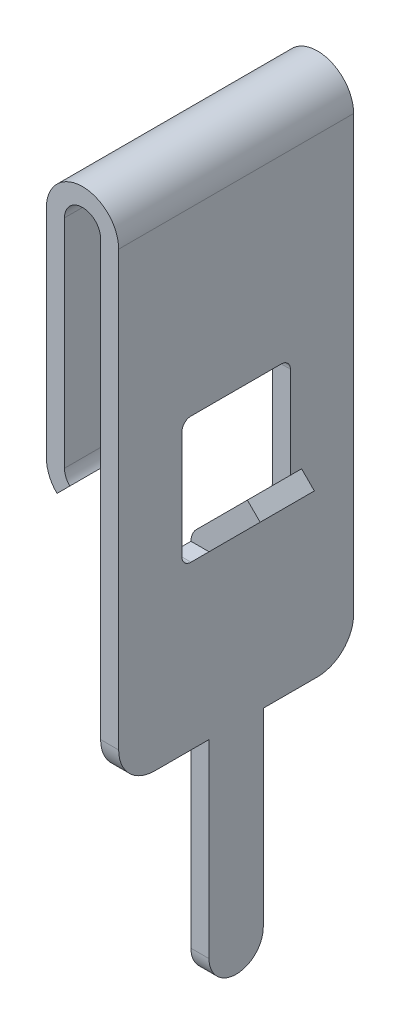
ISO-10303-21;
HEADER;
FILE_DESCRIPTION(('STEP AP214'),'2;1');
FILE_NAME('part.step','',(''),(''),'','','');
FILE_SCHEMA(('AUTOMOTIVE_DESIGN { 1 0 10303 214 1 1 1 1 }'));
ENDSEC;
DATA;
#1=APPLICATION_CONTEXT('core data for automotive mechanical design processes');
#2=APPLICATION_PROTOCOL_DEFINITION('international standard','automotive_design',2000,#1);
#3=PRODUCT_CONTEXT('',#1,'mechanical');
#4=PRODUCT('Part','Part','',(#3));
#5=PRODUCT_RELATED_PRODUCT_CATEGORY('part','',(#4));
#6=PRODUCT_DEFINITION_FORMATION('','',#4);
#7=PRODUCT_DEFINITION_CONTEXT('part definition',#1,'design');
#8=PRODUCT_DEFINITION('design','',#6,#7);
#9=PRODUCT_DEFINITION_SHAPE('','',#8);
#10=(LENGTH_UNIT() NAMED_UNIT(*) SI_UNIT(.MILLI.,.METRE.));
#11=(NAMED_UNIT(*) PLANE_ANGLE_UNIT() SI_UNIT($,.RADIAN.));
#12=(NAMED_UNIT(*) SI_UNIT($,.STERADIAN.) SOLID_ANGLE_UNIT());
#13=UNCERTAINTY_MEASURE_WITH_UNIT(LENGTH_MEASURE(1.E-05),#10,'distance_accuracy_value','');
#14=(GEOMETRIC_REPRESENTATION_CONTEXT(3) GLOBAL_UNCERTAINTY_ASSIGNED_CONTEXT((#13)) GLOBAL_UNIT_ASSIGNED_CONTEXT((#10,
#11,#12)) REPRESENTATION_CONTEXT('',''));
#15=CARTESIAN_POINT('',(0.,0.,0.));
#16=DIRECTION('',(0.,0.,1.));
#17=DIRECTION('',(1.,0.,0.));
#18=AXIS2_PLACEMENT_3D('',#15,#16,#17);
#19=CARTESIAN_POINT('',(0.,11.2071067811865,6.5));
#20=DIRECTION('',(-1.,0.,0.));
#21=DIRECTION('',(0.,-1.,0.));
#22=AXIS2_PLACEMENT_3D('',#19,#20,#21);
#23=PLANE('',#22);
#24=CARTESIAN_POINT('',(0.,7.,1.));
#25=DIRECTION('',(-1.,0.,0.));
#26=DIRECTION('',(0.,0.,1.));
#27=AXIS2_PLACEMENT_3D('',#24,#25,#26);
#28=CIRCLE('',#27,1.);
#29=CARTESIAN_POINT('',(0.,6.,1.));
#30=VERTEX_POINT('',#29);
#31=CARTESIAN_POINT('',(0.,7.,0.));
#32=VERTEX_POINT('',#31);
#33=EDGE_CURVE('E263',#30,#32,#28,.F.);
#34=ORIENTED_EDGE('',*,*,#33,.T.);
#35=DIRECTION('',(0.,1.,0.));
#36=VECTOR('',#35,1.);
#37=CARTESIAN_POINT('',(0.,11.2071067811865,0.));
#38=LINE('',#37,#36);
#39=CARTESIAN_POINT('',(0.,19.,0.));
#40=VERTEX_POINT('',#39);
#41=EDGE_CURVE('E266',#32,#40,#38,.T.);
#42=ORIENTED_EDGE('',*,*,#41,.T.);
#43=DIRECTION('',(0.,0.,-1.));
#44=VECTOR('',#43,1.);
#45=CARTESIAN_POINT('',(0.,19.,6.5));
#46=LINE('',#45,#44);
#47=CARTESIAN_POINT('',(0.,19.,6.5));
#48=VERTEX_POINT('',#47);
#49=EDGE_CURVE('E306',#48,#40,#46,.T.);
#50=ORIENTED_EDGE('',*,*,#49,.F.);
#51=DIRECTION('',(0.,1.,0.));
#52=VECTOR('',#51,1.);
#53=CARTESIAN_POINT('',(0.,11.2071067811865,6.5));
#54=LINE('',#53,#52);
#55=CARTESIAN_POINT('',(0.,7.,6.5));
#56=VERTEX_POINT('',#55);
#57=EDGE_CURVE('E338',#56,#48,#54,.T.);
#58=ORIENTED_EDGE('',*,*,#57,.F.);
#59=CARTESIAN_POINT('',(0.,7.,5.5));
#60=DIRECTION('',(-1.,0.,0.));
#61=DIRECTION('',(0.,0.,1.));
#62=AXIS2_PLACEMENT_3D('',#59,#60,#61);
#63=CIRCLE('',#62,1.);
#64=CARTESIAN_POINT('',(0.,6.,5.5));
#65=VERTEX_POINT('',#64);
#66=EDGE_CURVE('E348',#56,#65,#63,.F.);
#67=ORIENTED_EDGE('',*,*,#66,.T.);
#68=DIRECTION('',(0.,0.,-1.));
#69=VECTOR('',#68,1.);
#70=CARTESIAN_POINT('',(0.,6.,6.50000000000001));
#71=LINE('',#70,#69);
#72=CARTESIAN_POINT('',(0.,6.,4.));
#73=VERTEX_POINT('',#72);
#74=EDGE_CURVE('E377',#65,#73,#71,.T.);
#75=ORIENTED_EDGE('',*,*,#74,.T.);
#76=DIRECTION('',(0.,-1.,0.));
#77=VECTOR('',#76,1.);
#78=CARTESIAN_POINT('',(0.,0.,4.));
#79=LINE('',#78,#77);
#80=CARTESIAN_POINT('',(0.,0.749999999999999,4.));
#81=VERTEX_POINT('',#80);
#82=EDGE_CURVE('E374',#73,#81,#79,.T.);
#83=ORIENTED_EDGE('',*,*,#82,.T.);
#84=CARTESIAN_POINT('',(0.,0.749999999999999,3.25));
#85=DIRECTION('',(-1.,0.,0.));
#86=DIRECTION('',(0.,0.,1.));
#87=AXIS2_PLACEMENT_3D('',#84,#85,#86);
#88=CIRCLE('',#87,0.75);
#89=CARTESIAN_POINT('',(0.,0.749999999999999,2.5));
#90=VERTEX_POINT('',#89);
#91=EDGE_CURVE('E373',#81,#90,#88,.F.);
#92=ORIENTED_EDGE('',*,*,#91,.T.);
#93=DIRECTION('',(0.,1.,0.));
#94=VECTOR('',#93,1.);
#95=CARTESIAN_POINT('',(0.,0.,2.5));
#96=LINE('',#95,#94);
#97=CARTESIAN_POINT('',(0.,6.,2.5));
#98=VERTEX_POINT('',#97);
#99=EDGE_CURVE('E370',#90,#98,#96,.T.);
#100=ORIENTED_EDGE('',*,*,#99,.T.);
#101=DIRECTION('',(0.,0.,-1.));
#102=VECTOR('',#101,1.);
#103=CARTESIAN_POINT('',(0.,6.,6.49999999999999));
#104=LINE('',#103,#102);
#105=EDGE_CURVE('E346',#98,#30,#104,.T.);
#106=ORIENTED_EDGE('',*,*,#105,.T.);
#107=EDGE_LOOP('',(#34,#42,#50,#58,#67,#75,#83,#92,#100,#106));
#108=FACE_BOUND('',#107,.T.);
#109=DIRECTION('',(0.,0.,-1.));
#110=VECTOR('',#109,1.);
#111=CARTESIAN_POINT('',(0.,10.5,6.5));
#112=LINE('',#111,#110);
#113=CARTESIAN_POINT('',(0.,10.5,4.));
#114=VERTEX_POINT('',#113);
#115=CARTESIAN_POINT('',(0.,10.5,2.5));
#116=VERTEX_POINT('',#115);
#117=EDGE_CURVE('E239',#114,#116,#112,.T.);
#118=ORIENTED_EDGE('',*,*,#117,.F.);
#119=DIRECTION('',(0.,0.,-1.));
#120=VECTOR('',#119,1.);
#121=CARTESIAN_POINT('',(0.,10.5,3.25));
#122=LINE('',#121,#120);
#123=CARTESIAN_POINT('',(0.,10.5,4.5));
#124=VERTEX_POINT('',#123);
#125=EDGE_CURVE('E257',#124,#114,#122,.T.);
#126=ORIENTED_EDGE('',*,*,#125,.F.);
#127=CARTESIAN_POINT('',(0.,10.75,4.5));
#128=DIRECTION('',(1.,0.,0.));
#129=DIRECTION('',(0.,-1.,0.));
#130=AXIS2_PLACEMENT_3D('',#127,#128,#129);
#131=CIRCLE('',#130,0.25);
#132=CARTESIAN_POINT('',(0.,10.75,4.75));
#133=VERTEX_POINT('',#132);
#134=EDGE_CURVE('E429',#133,#124,#131,.T.);
#135=ORIENTED_EDGE('',*,*,#134,.F.);
#136=DIRECTION('',(0.,-1.,0.));
#137=VECTOR('',#136,1.);
#138=CARTESIAN_POINT('',(0.,10.75,4.75));
#139=LINE('',#138,#137);
#140=CARTESIAN_POINT('',(0.,13.75,4.75));
#141=VERTEX_POINT('',#140);
#142=EDGE_CURVE('E426',#141,#133,#139,.T.);
#143=ORIENTED_EDGE('',*,*,#142,.F.);
#144=CARTESIAN_POINT('',(0.,13.75,4.5));
#145=DIRECTION('',(1.,0.,0.));
#146=DIRECTION('',(0.,-1.,0.));
#147=AXIS2_PLACEMENT_3D('',#144,#145,#146);
#148=CIRCLE('',#147,0.25);
#149=CARTESIAN_POINT('',(0.,14.,4.5));
#150=VERTEX_POINT('',#149);
#151=EDGE_CURVE('E423',#150,#141,#148,.T.);
#152=ORIENTED_EDGE('',*,*,#151,.F.);
#153=DIRECTION('',(0.,0.,1.));
#154=VECTOR('',#153,1.);
#155=CARTESIAN_POINT('',(0.,14.,2.));
#156=LINE('',#155,#154);
#157=CARTESIAN_POINT('',(0.,14.,2.));
#158=VERTEX_POINT('',#157);
#159=EDGE_CURVE('E420',#158,#150,#156,.T.);
#160=ORIENTED_EDGE('',*,*,#159,.F.);
#161=CARTESIAN_POINT('',(0.,13.75,2.));
#162=DIRECTION('',(1.,0.,0.));
#163=DIRECTION('',(0.,1.,0.));
#164=AXIS2_PLACEMENT_3D('',#161,#162,#163);
#165=CIRCLE('',#164,0.25);
#166=CARTESIAN_POINT('',(0.,13.75,1.75));
#167=VERTEX_POINT('',#166);
#168=EDGE_CURVE('E417',#167,#158,#165,.T.);
#169=ORIENTED_EDGE('',*,*,#168,.F.);
#170=DIRECTION('',(0.,1.,0.));
#171=VECTOR('',#170,1.);
#172=CARTESIAN_POINT('',(0.,10.75,1.75));
#173=LINE('',#172,#171);
#174=CARTESIAN_POINT('',(0.,10.75,1.75));
#175=VERTEX_POINT('',#174);
#176=EDGE_CURVE('E414',#175,#167,#173,.T.);
#177=ORIENTED_EDGE('',*,*,#176,.F.);
#178=CARTESIAN_POINT('',(0.,10.75,2.));
#179=DIRECTION('',(1.,0.,0.));
#180=DIRECTION('',(0.,1.,0.));
#181=AXIS2_PLACEMENT_3D('',#178,#179,#180);
#182=CIRCLE('',#181,0.25);
#183=CARTESIAN_POINT('',(0.,10.5,2.));
#184=VERTEX_POINT('',#183);
#185=EDGE_CURVE('E253',#184,#175,#182,.T.);
#186=ORIENTED_EDGE('',*,*,#185,.F.);
#187=EDGE_CURVE('E250',#116,#184,#122,.T.);
#188=ORIENTED_EDGE('',*,*,#187,.F.);
#189=EDGE_LOOP('',(#118,#126,#135,#143,#152,#160,#169,#177,#186,#188));
#190=FACE_BOUND('',#189,.T.);
#191=ADVANCED_FACE('F38',(#108,#190),#23,.F.);
#192=CARTESIAN_POINT('',(-0.6,10.5,3.25));
#193=DIRECTION('',(0.,-1.,0.));
#194=DIRECTION('',(1.,0.,0.));
#195=AXIS2_PLACEMENT_3D('',#192,#193,#194);
#196=PLANE('',#195);
#197=DIRECTION('',(1.,0.,0.));
#198=VECTOR('',#197,1.);
#199=CARTESIAN_POINT('',(-0.5,10.5,2.5));
#200=LINE('',#199,#198);
#201=CARTESIAN_POINT('',(-0.5,10.5,2.5));
#202=VERTEX_POINT('',#201);
#203=EDGE_CURVE('E230',#202,#116,#200,.T.);
#204=ORIENTED_EDGE('',*,*,#203,.T.);
#205=ORIENTED_EDGE('',*,*,#187,.T.);
#206=DIRECTION('',(1.,0.,0.));
#207=VECTOR('',#206,1.);
#208=CARTESIAN_POINT('',(-0.6,10.5,2.));
#209=LINE('',#208,#207);
#210=CARTESIAN_POINT('',(-0.5,10.5,2.));
#211=VERTEX_POINT('',#210);
#212=EDGE_CURVE('E412',#211,#184,#209,.T.);
#213=ORIENTED_EDGE('',*,*,#212,.F.);
#214=DIRECTION('',(0.,0.,-1.));
#215=VECTOR('',#214,1.);
#216=CARTESIAN_POINT('',(-0.5,10.5,6.5));
#217=LINE('',#216,#215);
#218=EDGE_CURVE('E262',#202,#211,#217,.T.);
#219=ORIENTED_EDGE('',*,*,#218,.F.);
#220=EDGE_LOOP('',(#204,#205,#213,#219));
#221=FACE_BOUND('',#220,.T.);
#222=ADVANCED_FACE('F261',(#221),#196,.F.);
#223=DIRECTION('',(1.,0.,0.));
#224=VECTOR('',#223,1.);
#225=CARTESIAN_POINT('',(-0.5,10.5,4.));
#226=LINE('',#225,#224);
#227=CARTESIAN_POINT('',(-0.5,10.5,4.));
#228=VERTEX_POINT('',#227);
#229=EDGE_CURVE('E246',#228,#114,#226,.T.);
#230=ORIENTED_EDGE('',*,*,#229,.F.);
#231=CARTESIAN_POINT('',(-0.5,10.5,4.5));
#232=VERTEX_POINT('',#231);
#233=EDGE_CURVE('E294',#232,#228,#217,.T.);
#234=ORIENTED_EDGE('',*,*,#233,.F.);
#235=DIRECTION('',(1.,0.,0.));
#236=VECTOR('',#235,1.);
#237=CARTESIAN_POINT('',(-0.6,10.5,4.5));
#238=LINE('',#237,#236);
#239=EDGE_CURVE('E258',#232,#124,#238,.T.);
#240=ORIENTED_EDGE('',*,*,#239,.T.);
#241=ORIENTED_EDGE('',*,*,#125,.T.);
#242=EDGE_LOOP('',(#230,#234,#240,#241));
#243=FACE_BOUND('',#242,.T.);
#244=ADVANCED_FACE('F458',(#243),#196,.F.);
#245=CARTESIAN_POINT('',(-1.,19.,0.));
#246=DIRECTION('',(0.,0.,1.));
#247=DIRECTION('',(1.,0.,0.));
#248=AXIS2_PLACEMENT_3D('',#245,#246,#247);
#249=PLANE('',#248);
#250=ORIENTED_EDGE('',*,*,#41,.F.);
#251=DIRECTION('',(-1.,0.,0.));
#252=VECTOR('',#251,1.);
#253=CARTESIAN_POINT('',(1.5,7.,0.));
#254=LINE('',#253,#252);
#255=CARTESIAN_POINT('',(-0.5,7.,0.));
#256=VERTEX_POINT('',#255);
#257=EDGE_CURVE('E301',#256,#32,#254,.F.);
#258=ORIENTED_EDGE('',*,*,#257,.F.);
#259=DIRECTION('',(0.,-1.,0.));
#260=VECTOR('',#259,1.);
#261=CARTESIAN_POINT('',(-0.5,0.,0.));
#262=LINE('',#261,#260);
#263=CARTESIAN_POINT('',(-0.5,19.,0.));
#264=VERTEX_POINT('',#263);
#265=EDGE_CURVE('E335',#264,#256,#262,.T.);
#266=ORIENTED_EDGE('',*,*,#265,.F.);
#267=CARTESIAN_POINT('',(-1.,19.,0.));
#268=DIRECTION('',(0.,0.,-1.));
#269=DIRECTION('',(1.,0.,0.));
#270=AXIS2_PLACEMENT_3D('',#267,#268,#269);
#271=CIRCLE('',#270,0.5);
#272=CARTESIAN_POINT('',(-1.5,19.,0.));
#273=VERTEX_POINT('',#272);
#274=EDGE_CURVE('E330',#273,#264,#271,.T.);
#275=ORIENTED_EDGE('',*,*,#274,.F.);
#276=DIRECTION('',(0.,1.,0.));
#277=VECTOR('',#276,1.);
#278=CARTESIAN_POINT('',(-1.5,19.,0.));
#279=LINE('',#278,#277);
#280=CARTESIAN_POINT('',(-1.5,13.,0.));
#281=VERTEX_POINT('',#280);
#282=EDGE_CURVE('E326',#281,#273,#279,.T.);
#283=ORIENTED_EDGE('',*,*,#282,.F.);
#284=CARTESIAN_POINT('',(-1.,13.,0.));
#285=DIRECTION('',(0.,0.,-1.));
#286=DIRECTION('',(1.,0.,0.));
#287=AXIS2_PLACEMENT_3D('',#284,#285,#286);
#288=CIRCLE('',#287,0.499999999999999);
#289=CARTESIAN_POINT('',(-1.35355339059327,12.6464466094067,0.));
#290=VERTEX_POINT('',#289);
#291=EDGE_CURVE('E322',#290,#281,#288,.T.);
#292=ORIENTED_EDGE('',*,*,#291,.F.);
#293=DIRECTION('',(0.707106781186547,0.707106781186548,0.));
#294=VECTOR('',#293,1.);
#295=CARTESIAN_POINT('',(-1.70710678118655,12.2928932188135,0.));
#296=LINE('',#295,#294);
#297=CARTESIAN_POINT('',(-1.70710678118655,12.2928932188135,0.));
#298=VERTEX_POINT('',#297);
#299=EDGE_CURVE('E318',#298,#290,#296,.T.);
#300=ORIENTED_EDGE('',*,*,#299,.F.);
#301=CARTESIAN_POINT('',(-1.,13.,0.));
#302=DIRECTION('',(0.,0.,1.));
#303=DIRECTION('',(1.,0.,0.));
#304=AXIS2_PLACEMENT_3D('',#301,#302,#303);
#305=CIRCLE('',#304,0.999999999999999);
#306=CARTESIAN_POINT('',(-2.,13.,0.));
#307=VERTEX_POINT('',#306);
#308=EDGE_CURVE('E314',#307,#298,#305,.T.);
#309=ORIENTED_EDGE('',*,*,#308,.F.);
#310=DIRECTION('',(0.,-1.,0.));
#311=VECTOR('',#310,1.);
#312=CARTESIAN_POINT('',(-2.,19.,0.));
#313=LINE('',#312,#311);
#314=CARTESIAN_POINT('',(-2.,19.,0.));
#315=VERTEX_POINT('',#314);
#316=EDGE_CURVE('E309',#315,#307,#313,.T.);
#317=ORIENTED_EDGE('',*,*,#316,.F.);
#318=CARTESIAN_POINT('',(-1.,19.,0.));
#319=DIRECTION('',(0.,0.,1.));
#320=DIRECTION('',(1.,0.,0.));
#321=AXIS2_PLACEMENT_3D('',#318,#319,#320);
#322=CIRCLE('',#321,1.);
#323=EDGE_CURVE('E310',#40,#315,#322,.T.);
#324=ORIENTED_EDGE('',*,*,#323,.F.);
#325=EDGE_LOOP('',(#250,#258,#266,#275,#283,#292,#300,#309,#317,#324));
#326=FACE_BOUND('',#325,.T.);
#327=ADVANCED_FACE('F507',(#326),#249,.F.);
#328=CARTESIAN_POINT('',(-1.,19.,6.5));
#329=DIRECTION('',(0.,0.,-1.));
#330=DIRECTION('',(-1.,0.,0.));
#331=AXIS2_PLACEMENT_3D('',#328,#329,#330);
#332=CYLINDRICAL_SURFACE('',#331,1.);
#333=ORIENTED_EDGE('',*,*,#323,.T.);
#334=DIRECTION('',(0.,0.,-1.));
#335=VECTOR('',#334,1.);
#336=CARTESIAN_POINT('',(-2.,19.,6.5));
#337=LINE('',#336,#335);
#338=CARTESIAN_POINT('',(-2.,19.,6.5));
#339=VERTEX_POINT('',#338);
#340=EDGE_CURVE('E311',#339,#315,#337,.T.);
#341=ORIENTED_EDGE('',*,*,#340,.F.);
#342=CARTESIAN_POINT('',(-1.,19.,6.5));
#343=DIRECTION('',(0.,0.,1.));
#344=DIRECTION('',(1.,0.,0.));
#345=AXIS2_PLACEMENT_3D('',#342,#343,#344);
#346=CIRCLE('',#345,1.);
#347=EDGE_CURVE('E365',#48,#339,#346,.T.);
#348=ORIENTED_EDGE('',*,*,#347,.F.);
#349=ORIENTED_EDGE('',*,*,#49,.T.);
#350=EDGE_LOOP('',(#333,#341,#348,#349));
#351=FACE_BOUND('',#350,.T.);
#352=ADVANCED_FACE('F503',(#351),#332,.T.);
#353=CARTESIAN_POINT('',(-2.,19.,6.5));
#354=DIRECTION('',(1.,0.,0.));
#355=DIRECTION('',(0.,1.,0.));
#356=AXIS2_PLACEMENT_3D('',#353,#354,#355);
#357=PLANE('',#356);
#358=ORIENTED_EDGE('',*,*,#316,.T.);
#359=DIRECTION('',(0.,0.,-1.));
#360=VECTOR('',#359,1.);
#361=CARTESIAN_POINT('',(-2.,13.,6.5));
#362=LINE('',#361,#360);
#363=CARTESIAN_POINT('',(-2.,13.,6.5));
#364=VERTEX_POINT('',#363);
#365=EDGE_CURVE('E315',#364,#307,#362,.T.);
#366=ORIENTED_EDGE('',*,*,#365,.F.);
#367=DIRECTION('',(0.,-1.,0.));
#368=VECTOR('',#367,1.);
#369=CARTESIAN_POINT('',(-2.,19.,6.5));
#370=LINE('',#369,#368);
#371=EDGE_CURVE('E363',#339,#364,#370,.T.);
#372=ORIENTED_EDGE('',*,*,#371,.F.);
#373=ORIENTED_EDGE('',*,*,#340,.T.);
#374=EDGE_LOOP('',(#358,#366,#372,#373));
#375=FACE_BOUND('',#374,.T.);
#376=ADVANCED_FACE('F506',(#375),#357,.F.);
#377=CARTESIAN_POINT('',(-1.,13.,6.5));
#378=DIRECTION('',(0.,0.,-1.));
#379=DIRECTION('',(-1.,0.,0.));
#380=AXIS2_PLACEMENT_3D('',#377,#378,#379);
#381=CYLINDRICAL_SURFACE('',#380,0.999999999999999);
#382=ORIENTED_EDGE('',*,*,#308,.T.);
#383=DIRECTION('',(0.,0.,-1.));
#384=VECTOR('',#383,1.);
#385=CARTESIAN_POINT('',(-1.70710678118655,12.2928932188135,6.5));
#386=LINE('',#385,#384);
#387=CARTESIAN_POINT('',(-1.70710678118655,12.2928932188135,6.5));
#388=VERTEX_POINT('',#387);
#389=EDGE_CURVE('E319',#388,#298,#386,.T.);
#390=ORIENTED_EDGE('',*,*,#389,.F.);
#391=CARTESIAN_POINT('',(-1.,13.,6.5));
#392=DIRECTION('',(0.,0.,1.));
#393=DIRECTION('',(1.,0.,0.));
#394=AXIS2_PLACEMENT_3D('',#391,#392,#393);
#395=CIRCLE('',#394,0.999999999999999);
#396=EDGE_CURVE('E361',#364,#388,#395,.T.);
#397=ORIENTED_EDGE('',*,*,#396,.F.);
#398=ORIENTED_EDGE('',*,*,#365,.T.);
#399=EDGE_LOOP('',(#382,#390,#397,#398));
#400=FACE_BOUND('',#399,.T.);
#401=ADVANCED_FACE('F511',(#400),#381,.T.);
#402=CARTESIAN_POINT('',(-1.70710678118655,12.2928932188135,6.5));
#403=DIRECTION('',(-0.707106781186548,0.707106781186547,0.));
#404=DIRECTION('',(-0.707106781186547,-0.707106781186548,0.));
#405=AXIS2_PLACEMENT_3D('',#402,#403,#404);
#406=PLANE('',#405);
#407=ORIENTED_EDGE('',*,*,#299,.T.);
#408=DIRECTION('',(0.,0.,-1.));
#409=VECTOR('',#408,1.);
#410=CARTESIAN_POINT('',(-1.35355339059327,12.6464466094067,6.5));
#411=LINE('',#410,#409);
#412=CARTESIAN_POINT('',(-1.35355339059327,12.6464466094067,6.5));
#413=VERTEX_POINT('',#412);
#414=EDGE_CURVE('E323',#413,#290,#411,.T.);
#415=ORIENTED_EDGE('',*,*,#414,.F.);
#416=DIRECTION('',(0.707106781186547,0.707106781186548,0.));
#417=VECTOR('',#416,1.);
#418=CARTESIAN_POINT('',(-1.70710678118655,12.2928932188135,6.5));
#419=LINE('',#418,#417);
#420=EDGE_CURVE('E359',#388,#413,#419,.T.);
#421=ORIENTED_EDGE('',*,*,#420,.F.);
#422=ORIENTED_EDGE('',*,*,#389,.T.);
#423=EDGE_LOOP('',(#407,#415,#421,#422));
#424=FACE_BOUND('',#423,.T.);
#425=ADVANCED_FACE('F515',(#424),#406,.F.);
#426=CARTESIAN_POINT('',(-1.,13.,6.5));
#427=DIRECTION('',(0.,0.,-1.));
#428=DIRECTION('',(-1.,0.,0.));
#429=AXIS2_PLACEMENT_3D('',#426,#427,#428);
#430=CYLINDRICAL_SURFACE('',#429,0.499999999999999);
#431=ORIENTED_EDGE('',*,*,#291,.T.);
#432=DIRECTION('',(0.,0.,-1.));
#433=VECTOR('',#432,1.);
#434=CARTESIAN_POINT('',(-1.5,13.,6.5));
#435=LINE('',#434,#433);
#436=CARTESIAN_POINT('',(-1.5,13.,6.5));
#437=VERTEX_POINT('',#436);
#438=EDGE_CURVE('E327',#437,#281,#435,.T.);
#439=ORIENTED_EDGE('',*,*,#438,.F.);
#440=CARTESIAN_POINT('',(-1.,13.,6.5));
#441=DIRECTION('',(0.,0.,-1.));
#442=DIRECTION('',(1.,0.,0.));
#443=AXIS2_PLACEMENT_3D('',#440,#441,#442);
#444=CIRCLE('',#443,0.499999999999999);
#445=EDGE_CURVE('E357',#413,#437,#444,.T.);
#446=ORIENTED_EDGE('',*,*,#445,.F.);
#447=ORIENTED_EDGE('',*,*,#414,.T.);
#448=EDGE_LOOP('',(#431,#439,#446,#447));
#449=FACE_BOUND('',#448,.T.);
#450=ADVANCED_FACE('F519',(#449),#430,.F.);
#451=CARTESIAN_POINT('',(-1.5,19.,6.5));
#452=DIRECTION('',(-1.,0.,0.));
#453=DIRECTION('',(0.,-1.,0.));
#454=AXIS2_PLACEMENT_3D('',#451,#452,#453);
#455=PLANE('',#454);
#456=ORIENTED_EDGE('',*,*,#282,.T.);
#457=DIRECTION('',(0.,0.,-1.));
#458=VECTOR('',#457,1.);
#459=CARTESIAN_POINT('',(-1.5,19.,6.5));
#460=LINE('',#459,#458);
#461=CARTESIAN_POINT('',(-1.5,19.,6.5));
#462=VERTEX_POINT('',#461);
#463=EDGE_CURVE('E277',#462,#273,#460,.T.);
#464=ORIENTED_EDGE('',*,*,#463,.F.);
#465=DIRECTION('',(0.,1.,0.));
#466=VECTOR('',#465,1.);
#467=CARTESIAN_POINT('',(-1.5,19.,6.5));
#468=LINE('',#467,#466);
#469=EDGE_CURVE('E355',#437,#462,#468,.T.);
#470=ORIENTED_EDGE('',*,*,#469,.F.);
#471=ORIENTED_EDGE('',*,*,#438,.T.);
#472=EDGE_LOOP('',(#456,#464,#470,#471));
#473=FACE_BOUND('',#472,.T.);
#474=ADVANCED_FACE('F523',(#473),#455,.F.);
#475=CARTESIAN_POINT('',(-1.,19.,6.5));
#476=DIRECTION('',(0.,0.,-1.));
#477=DIRECTION('',(-1.,0.,0.));
#478=AXIS2_PLACEMENT_3D('',#475,#476,#477);
#479=CYLINDRICAL_SURFACE('',#478,0.5);
#480=ORIENTED_EDGE('',*,*,#274,.T.);
#481=DIRECTION('',(0.,0.,-1.));
#482=VECTOR('',#481,1.);
#483=CARTESIAN_POINT('',(-0.5,19.,6.5));
#484=LINE('',#483,#482);
#485=CARTESIAN_POINT('',(-0.5,19.,6.5));
#486=VERTEX_POINT('',#485);
#487=EDGE_CURVE('E281',#486,#264,#484,.T.);
#488=ORIENTED_EDGE('',*,*,#487,.F.);
#489=CARTESIAN_POINT('',(-1.,19.,6.5));
#490=DIRECTION('',(0.,0.,-1.));
#491=DIRECTION('',(1.,0.,0.));
#492=AXIS2_PLACEMENT_3D('',#489,#490,#491);
#493=CIRCLE('',#492,0.5);
#494=EDGE_CURVE('E353',#462,#486,#493,.T.);
#495=ORIENTED_EDGE('',*,*,#494,.F.);
#496=ORIENTED_EDGE('',*,*,#463,.T.);
#497=EDGE_LOOP('',(#480,#488,#495,#496));
#498=FACE_BOUND('',#497,.T.);
#499=ADVANCED_FACE('F527',(#498),#479,.F.);
#500=CARTESIAN_POINT('',(-0.5,0.,6.5));
#501=DIRECTION('',(1.,0.,0.));
#502=DIRECTION('',(0.,0.,-1.));
#503=AXIS2_PLACEMENT_3D('',#500,#501,#502);
#504=PLANE('',#503);
#505=ORIENTED_EDGE('',*,*,#233,.T.);
#506=DIRECTION('',(0.,0.,-1.));
#507=VECTOR('',#506,1.);
#508=CARTESIAN_POINT('',(-0.5,10.5,6.5));
#509=LINE('',#508,#507);
#510=EDGE_CURVE('E445',#228,#202,#509,.T.);
#511=ORIENTED_EDGE('',*,*,#510,.T.);
#512=ORIENTED_EDGE('',*,*,#218,.T.);
#513=CARTESIAN_POINT('',(-0.5,10.75,2.));
#514=DIRECTION('',(1.,0.,0.));
#515=DIRECTION('',(0.,0.,-1.));
#516=AXIS2_PLACEMENT_3D('',#513,#514,#515);
#517=CIRCLE('',#516,0.25);
#518=CARTESIAN_POINT('',(-0.5,10.75,1.75));
#519=VERTEX_POINT('',#518);
#520=EDGE_CURVE('E291',#211,#519,#517,.T.);
#521=ORIENTED_EDGE('',*,*,#520,.T.);
#522=DIRECTION('',(0.,1.,0.));
#523=VECTOR('',#522,1.);
#524=CARTESIAN_POINT('',(-0.5,0.,1.75));
#525=LINE('',#524,#523);
#526=CARTESIAN_POINT('',(-0.5,13.75,1.75));
#527=VERTEX_POINT('',#526);
#528=EDGE_CURVE('E288',#519,#527,#525,.T.);
#529=ORIENTED_EDGE('',*,*,#528,.T.);
#530=CARTESIAN_POINT('',(-0.5,13.75,2.));
#531=DIRECTION('',(1.,0.,0.));
#532=DIRECTION('',(0.,0.,-1.));
#533=AXIS2_PLACEMENT_3D('',#530,#531,#532);
#534=CIRCLE('',#533,0.25);
#535=CARTESIAN_POINT('',(-0.5,14.,2.));
#536=VERTEX_POINT('',#535);
#537=EDGE_CURVE('E285',#527,#536,#534,.T.);
#538=ORIENTED_EDGE('',*,*,#537,.T.);
#539=DIRECTION('',(0.,0.,1.));
#540=VECTOR('',#539,1.);
#541=CARTESIAN_POINT('',(-0.5,14.,6.5));
#542=LINE('',#541,#540);
#543=CARTESIAN_POINT('',(-0.5,14.,4.5));
#544=VERTEX_POINT('',#543);
#545=EDGE_CURVE('E282',#536,#544,#542,.T.);
#546=ORIENTED_EDGE('',*,*,#545,.T.);
#547=CARTESIAN_POINT('',(-0.5,13.75,4.5));
#548=DIRECTION('',(1.,0.,0.));
#549=DIRECTION('',(0.,0.,-1.));
#550=AXIS2_PLACEMENT_3D('',#547,#548,#549);
#551=CIRCLE('',#550,0.25);
#552=CARTESIAN_POINT('',(-0.5,13.75,4.75));
#553=VERTEX_POINT('',#552);
#554=EDGE_CURVE('E278',#544,#553,#551,.T.);
#555=ORIENTED_EDGE('',*,*,#554,.T.);
#556=DIRECTION('',(0.,-1.,0.));
#557=VECTOR('',#556,1.);
#558=CARTESIAN_POINT('',(-0.5,0.,4.75));
#559=LINE('',#558,#557);
#560=CARTESIAN_POINT('',(-0.5,10.75,4.75));
#561=VERTEX_POINT('',#560);
#562=EDGE_CURVE('E274',#553,#561,#559,.T.);
#563=ORIENTED_EDGE('',*,*,#562,.T.);
#564=CARTESIAN_POINT('',(-0.5,10.75,4.5));
#565=DIRECTION('',(1.,0.,0.));
#566=DIRECTION('',(0.,0.,-1.));
#567=AXIS2_PLACEMENT_3D('',#564,#565,#566);
#568=CIRCLE('',#567,0.25);
#569=EDGE_CURVE('E271',#561,#232,#568,.T.);
#570=ORIENTED_EDGE('',*,*,#569,.T.);
#571=EDGE_LOOP('',(#505,#511,#512,#521,#529,#538,#546,#555,#563,#570));
#572=FACE_BOUND('',#571,.T.);
#573=DIRECTION('',(0.,0.,-1.));
#574=VECTOR('',#573,1.);
#575=CARTESIAN_POINT('',(-0.5,6.,4.));
#576=LINE('',#575,#574);
#577=CARTESIAN_POINT('',(-0.5,6.,5.5));
#578=VERTEX_POINT('',#577);
#579=CARTESIAN_POINT('',(-0.5,6.,4.));
#580=VERTEX_POINT('',#579);
#581=EDGE_CURVE('E385',#578,#580,#576,.T.);
#582=ORIENTED_EDGE('',*,*,#581,.F.);
#583=CARTESIAN_POINT('',(-0.5,7.,5.5));
#584=DIRECTION('',(1.,0.,0.));
#585=DIRECTION('',(0.,0.,1.));
#586=AXIS2_PLACEMENT_3D('',#583,#584,#585);
#587=CIRCLE('',#586,1.);
#588=CARTESIAN_POINT('',(-0.5,7.,6.5));
#589=VERTEX_POINT('',#588);
#590=EDGE_CURVE('E299',#589,#578,#587,.T.);
#591=ORIENTED_EDGE('',*,*,#590,.F.);
#592=DIRECTION('',(0.,-1.,0.));
#593=VECTOR('',#592,1.);
#594=CARTESIAN_POINT('',(-0.5,0.,6.5));
#595=LINE('',#594,#593);
#596=EDGE_CURVE('E349',#486,#589,#595,.T.);
#597=ORIENTED_EDGE('',*,*,#596,.F.);
#598=ORIENTED_EDGE('',*,*,#487,.T.);
#599=ORIENTED_EDGE('',*,*,#265,.T.);
#600=CARTESIAN_POINT('',(-0.5,7.,1.));
#601=DIRECTION('',(1.,0.,0.));
#602=DIRECTION('',(0.,0.,1.));
#603=AXIS2_PLACEMENT_3D('',#600,#601,#602);
#604=CIRCLE('',#603,1.);
#605=CARTESIAN_POINT('',(-0.5,6.,1.));
#606=VERTEX_POINT('',#605);
#607=EDGE_CURVE('E305',#606,#256,#604,.T.);
#608=ORIENTED_EDGE('',*,*,#607,.F.);
#609=DIRECTION('',(0.,0.,-1.));
#610=VECTOR('',#609,1.);
#611=CARTESIAN_POINT('',(-0.5,6.,1.));
#612=LINE('',#611,#610);
#613=CARTESIAN_POINT('',(-0.5,6.,2.5));
#614=VERTEX_POINT('',#613);
#615=EDGE_CURVE('E395',#614,#606,#612,.T.);
#616=ORIENTED_EDGE('',*,*,#615,.F.);
#617=DIRECTION('',(0.,1.,0.));
#618=VECTOR('',#617,1.);
#619=CARTESIAN_POINT('',(-0.5,0.749999999999999,2.5));
#620=LINE('',#619,#618);
#621=CARTESIAN_POINT('',(-0.5,0.749999999999999,2.5));
#622=VERTEX_POINT('',#621);
#623=EDGE_CURVE('E389',#622,#614,#620,.T.);
#624=ORIENTED_EDGE('',*,*,#623,.F.);
#625=CARTESIAN_POINT('',(-0.5,0.749999999999999,3.25));
#626=DIRECTION('',(1.,0.,0.));
#627=DIRECTION('',(0.,0.,1.));
#628=AXIS2_PLACEMENT_3D('',#625,#626,#627);
#629=CIRCLE('',#628,0.75);
#630=CARTESIAN_POINT('',(-0.5,0.749999999999999,4.));
#631=VERTEX_POINT('',#630);
#632=EDGE_CURVE('E300',#631,#622,#629,.T.);
#633=ORIENTED_EDGE('',*,*,#632,.F.);
#634=DIRECTION('',(0.,-1.,0.));
#635=VECTOR('',#634,1.);
#636=CARTESIAN_POINT('',(-0.5,0.749999999999999,4.));
#637=LINE('',#636,#635);
#638=EDGE_CURVE('E386',#580,#631,#637,.T.);
#639=ORIENTED_EDGE('',*,*,#638,.F.);
#640=EDGE_LOOP('',(#582,#591,#597,#598,#599,#608,#616,#624,#633,#639));
#641=FACE_BOUND('',#640,.T.);
#642=ADVANCED_FACE('F450',(#572,#641),#504,.F.);
#643=CARTESIAN_POINT('',(-1.,19.,6.5));
#644=DIRECTION('',(0.,0.,1.));
#645=DIRECTION('',(1.,0.,0.));
#646=AXIS2_PLACEMENT_3D('',#643,#644,#645);
#647=PLANE('',#646);
#648=DIRECTION('',(-1.,0.,0.));
#649=VECTOR('',#648,1.);
#650=CARTESIAN_POINT('',(-1.,7.,6.5));
#651=LINE('',#650,#649);
#652=EDGE_CURVE('E297',#56,#589,#651,.T.);
#653=ORIENTED_EDGE('',*,*,#652,.F.);
#654=ORIENTED_EDGE('',*,*,#57,.T.);
#655=ORIENTED_EDGE('',*,*,#347,.T.);
#656=ORIENTED_EDGE('',*,*,#371,.T.);
#657=ORIENTED_EDGE('',*,*,#396,.T.);
#658=ORIENTED_EDGE('',*,*,#420,.T.);
#659=ORIENTED_EDGE('',*,*,#445,.T.);
#660=ORIENTED_EDGE('',*,*,#469,.T.);
#661=ORIENTED_EDGE('',*,*,#494,.T.);
#662=ORIENTED_EDGE('',*,*,#596,.T.);
#663=EDGE_LOOP('',(#653,#654,#655,#656,#657,#658,#659,#660,#661,#662));
#664=FACE_BOUND('',#663,.T.);
#665=ADVANCED_FACE('F534',(#664),#647,.T.);
#666=CARTESIAN_POINT('',(1.5,6.,1.));
#667=DIRECTION('',(0.,1.,0.));
#668=DIRECTION('',(0.,0.,1.));
#669=AXIS2_PLACEMENT_3D('',#666,#667,#668);
#670=PLANE('',#669);
#671=DIRECTION('',(-1.,0.,0.));
#672=VECTOR('',#671,1.);
#673=CARTESIAN_POINT('',(1.5,6.,2.5));
#674=LINE('',#673,#672);
#675=EDGE_CURVE('E352',#98,#614,#674,.T.);
#676=ORIENTED_EDGE('',*,*,#675,.T.);
#677=ORIENTED_EDGE('',*,*,#615,.T.);
#678=DIRECTION('',(-1.,0.,0.));
#679=VECTOR('',#678,1.);
#680=CARTESIAN_POINT('',(1.5,6.,1.));
#681=LINE('',#680,#679);
#682=EDGE_CURVE('E397',#30,#606,#681,.T.);
#683=ORIENTED_EDGE('',*,*,#682,.F.);
#684=ORIENTED_EDGE('',*,*,#105,.F.);
#685=EDGE_LOOP('',(#676,#677,#683,#684));
#686=FACE_BOUND('',#685,.T.);
#687=ADVANCED_FACE('F540',(#686),#670,.F.);
#688=CARTESIAN_POINT('',(1.5,0.749999999999999,2.5));
#689=DIRECTION('',(0.,0.,1.));
#690=DIRECTION('',(1.,0.,0.));
#691=AXIS2_PLACEMENT_3D('',#688,#689,#690);
#692=PLANE('',#691);
#693=DIRECTION('',(-1.,0.,0.));
#694=VECTOR('',#693,1.);
#695=CARTESIAN_POINT('',(1.5,0.749999999999999,2.5));
#696=LINE('',#695,#694);
#697=EDGE_CURVE('E393',#90,#622,#696,.T.);
#698=ORIENTED_EDGE('',*,*,#697,.T.);
#699=ORIENTED_EDGE('',*,*,#623,.T.);
#700=ORIENTED_EDGE('',*,*,#675,.F.);
#701=ORIENTED_EDGE('',*,*,#99,.F.);
#702=EDGE_LOOP('',(#698,#699,#700,#701));
#703=FACE_BOUND('',#702,.T.);
#704=ADVANCED_FACE('F555',(#703),#692,.F.);
#705=CARTESIAN_POINT('',(1.5,0.749999999999999,4.));
#706=DIRECTION('',(0.,0.,-1.));
#707=DIRECTION('',(-1.,0.,0.));
#708=AXIS2_PLACEMENT_3D('',#705,#706,#707);
#709=PLANE('',#708);
#710=DIRECTION('',(-1.,0.,0.));
#711=VECTOR('',#710,1.);
#712=CARTESIAN_POINT('',(1.5,6.,4.));
#713=LINE('',#712,#711);
#714=EDGE_CURVE('E387',#73,#580,#713,.T.);
#715=ORIENTED_EDGE('',*,*,#714,.T.);
#716=ORIENTED_EDGE('',*,*,#638,.T.);
#717=DIRECTION('',(-1.,0.,0.));
#718=VECTOR('',#717,1.);
#719=CARTESIAN_POINT('',(1.5,0.749999999999999,4.));
#720=LINE('',#719,#718);
#721=EDGE_CURVE('E390',#81,#631,#720,.T.);
#722=ORIENTED_EDGE('',*,*,#721,.F.);
#723=ORIENTED_EDGE('',*,*,#82,.F.);
#724=EDGE_LOOP('',(#715,#716,#722,#723));
#725=FACE_BOUND('',#724,.T.);
#726=ADVANCED_FACE('F551',(#725),#709,.F.);
#727=CARTESIAN_POINT('',(1.5,6.,4.));
#728=DIRECTION('',(0.,1.,0.));
#729=DIRECTION('',(0.,0.,1.));
#730=AXIS2_PLACEMENT_3D('',#727,#728,#729);
#731=PLANE('',#730);
#732=DIRECTION('',(-1.,0.,0.));
#733=VECTOR('',#732,1.);
#734=CARTESIAN_POINT('',(1.5,6.,5.5));
#735=LINE('',#734,#733);
#736=EDGE_CURVE('E383',#65,#578,#735,.T.);
#737=ORIENTED_EDGE('',*,*,#736,.T.);
#738=ORIENTED_EDGE('',*,*,#581,.T.);
#739=ORIENTED_EDGE('',*,*,#714,.F.);
#740=ORIENTED_EDGE('',*,*,#74,.F.);
#741=EDGE_LOOP('',(#737,#738,#739,#740));
#742=FACE_BOUND('',#741,.T.);
#743=ADVANCED_FACE('F548',(#742),#731,.F.);
#744=CARTESIAN_POINT('',(1.5,0.749999999999999,3.25));
#745=DIRECTION('',(-1.,0.,0.));
#746=DIRECTION('',(0.,0.,1.));
#747=AXIS2_PLACEMENT_3D('',#744,#745,#746);
#748=CYLINDRICAL_SURFACE('',#747,0.75);
#749=ORIENTED_EDGE('',*,*,#721,.T.);
#750=ORIENTED_EDGE('',*,*,#632,.T.);
#751=ORIENTED_EDGE('',*,*,#697,.F.);
#752=ORIENTED_EDGE('',*,*,#91,.F.);
#753=EDGE_LOOP('',(#749,#750,#751,#752));
#754=FACE_BOUND('',#753,.T.);
#755=ADVANCED_FACE('F546',(#754),#748,.T.);
#756=CARTESIAN_POINT('',(1.5,7.,5.5));
#757=DIRECTION('',(-1.,0.,0.));
#758=DIRECTION('',(0.,0.,1.));
#759=AXIS2_PLACEMENT_3D('',#756,#757,#758);
#760=CYLINDRICAL_SURFACE('',#759,1.);
#761=ORIENTED_EDGE('',*,*,#652,.T.);
#762=ORIENTED_EDGE('',*,*,#590,.T.);
#763=ORIENTED_EDGE('',*,*,#736,.F.);
#764=ORIENTED_EDGE('',*,*,#66,.F.);
#765=EDGE_LOOP('',(#761,#762,#763,#764));
#766=FACE_BOUND('',#765,.T.);
#767=ADVANCED_FACE('F542',(#766),#760,.T.);
#768=CARTESIAN_POINT('',(1.5,7.,1.));
#769=DIRECTION('',(-1.,0.,0.));
#770=DIRECTION('',(0.,0.,1.));
#771=AXIS2_PLACEMENT_3D('',#768,#769,#770);
#772=CYLINDRICAL_SURFACE('',#771,1.);
#773=ORIENTED_EDGE('',*,*,#682,.T.);
#774=ORIENTED_EDGE('',*,*,#607,.T.);
#775=ORIENTED_EDGE('',*,*,#257,.T.);
#776=ORIENTED_EDGE('',*,*,#33,.F.);
#777=EDGE_LOOP('',(#773,#774,#775,#776));
#778=FACE_BOUND('',#777,.T.);
#779=ADVANCED_FACE('F545',(#778),#772,.T.);
#780=CARTESIAN_POINT('',(-0.6,10.75,4.5));
#781=DIRECTION('',(1.,0.,0.));
#782=DIRECTION('',(0.,1.,0.));
#783=AXIS2_PLACEMENT_3D('',#780,#781,#782);
#784=CYLINDRICAL_SURFACE('',#783,0.25);
#785=DIRECTION('',(1.,0.,0.));
#786=VECTOR('',#785,1.);
#787=CARTESIAN_POINT('',(-0.6,10.75,4.75));
#788=LINE('',#787,#786);
#789=EDGE_CURVE('E304',#561,#133,#788,.T.);
#790=ORIENTED_EDGE('',*,*,#789,.T.);
#791=ORIENTED_EDGE('',*,*,#134,.T.);
#792=ORIENTED_EDGE('',*,*,#239,.F.);
#793=ORIENTED_EDGE('',*,*,#569,.F.);
#794=EDGE_LOOP('',(#790,#791,#792,#793));
#795=FACE_BOUND('',#794,.T.);
#796=ADVANCED_FACE('F464',(#795),#784,.F.);
#797=CARTESIAN_POINT('',(-0.6,10.75,4.75));
#798=DIRECTION('',(0.,0.,1.));
#799=DIRECTION('',(1.,0.,0.));
#800=AXIS2_PLACEMENT_3D('',#797,#798,#799);
#801=PLANE('',#800);
#802=DIRECTION('',(1.,0.,0.));
#803=VECTOR('',#802,1.);
#804=CARTESIAN_POINT('',(-0.6,13.75,4.75));
#805=LINE('',#804,#803);
#806=EDGE_CURVE('E427',#553,#141,#805,.T.);
#807=ORIENTED_EDGE('',*,*,#806,.T.);
#808=ORIENTED_EDGE('',*,*,#142,.T.);
#809=ORIENTED_EDGE('',*,*,#789,.F.);
#810=ORIENTED_EDGE('',*,*,#562,.F.);
#811=EDGE_LOOP('',(#807,#808,#809,#810));
#812=FACE_BOUND('',#811,.T.);
#813=ADVANCED_FACE('F467',(#812),#801,.F.);
#814=CARTESIAN_POINT('',(-0.6,13.75,4.5));
#815=DIRECTION('',(1.,0.,0.));
#816=DIRECTION('',(0.,1.,0.));
#817=AXIS2_PLACEMENT_3D('',#814,#815,#816);
#818=CYLINDRICAL_SURFACE('',#817,0.25);
#819=DIRECTION('',(1.,0.,0.));
#820=VECTOR('',#819,1.);
#821=CARTESIAN_POINT('',(-0.6,14.,4.5));
#822=LINE('',#821,#820);
#823=EDGE_CURVE('E424',#544,#150,#822,.T.);
#824=ORIENTED_EDGE('',*,*,#823,.T.);
#825=ORIENTED_EDGE('',*,*,#151,.T.);
#826=ORIENTED_EDGE('',*,*,#806,.F.);
#827=ORIENTED_EDGE('',*,*,#554,.F.);
#828=EDGE_LOOP('',(#824,#825,#826,#827));
#829=FACE_BOUND('',#828,.T.);
#830=ADVANCED_FACE('F470',(#829),#818,.F.);
#831=CARTESIAN_POINT('',(-0.6,14.,2.));
#832=DIRECTION('',(0.,1.,0.));
#833=DIRECTION('',(-1.,0.,0.));
#834=AXIS2_PLACEMENT_3D('',#831,#832,#833);
#835=PLANE('',#834);
#836=DIRECTION('',(1.,0.,0.));
#837=VECTOR('',#836,1.);
#838=CARTESIAN_POINT('',(-0.6,14.,2.));
#839=LINE('',#838,#837);
#840=EDGE_CURVE('E421',#536,#158,#839,.T.);
#841=ORIENTED_EDGE('',*,*,#840,.T.);
#842=ORIENTED_EDGE('',*,*,#159,.T.);
#843=ORIENTED_EDGE('',*,*,#823,.F.);
#844=ORIENTED_EDGE('',*,*,#545,.F.);
#845=EDGE_LOOP('',(#841,#842,#843,#844));
#846=FACE_BOUND('',#845,.T.);
#847=ADVANCED_FACE('F475',(#846),#835,.F.);
#848=CARTESIAN_POINT('',(-0.6,13.75,2.));
#849=DIRECTION('',(1.,0.,0.));
#850=DIRECTION('',(0.,1.,0.));
#851=AXIS2_PLACEMENT_3D('',#848,#849,#850);
#852=CYLINDRICAL_SURFACE('',#851,0.25);
#853=DIRECTION('',(1.,0.,0.));
#854=VECTOR('',#853,1.);
#855=CARTESIAN_POINT('',(-0.6,13.75,1.75));
#856=LINE('',#855,#854);
#857=EDGE_CURVE('E418',#527,#167,#856,.T.);
#858=ORIENTED_EDGE('',*,*,#857,.T.);
#859=ORIENTED_EDGE('',*,*,#168,.T.);
#860=ORIENTED_EDGE('',*,*,#840,.F.);
#861=ORIENTED_EDGE('',*,*,#537,.F.);
#862=EDGE_LOOP('',(#858,#859,#860,#861));
#863=FACE_BOUND('',#862,.T.);
#864=ADVANCED_FACE('F478',(#863),#852,.F.);
#865=CARTESIAN_POINT('',(-0.6,10.75,1.75));
#866=DIRECTION('',(0.,0.,-1.));
#867=DIRECTION('',(-1.,0.,0.));
#868=AXIS2_PLACEMENT_3D('',#865,#866,#867);
#869=PLANE('',#868);
#870=DIRECTION('',(1.,0.,0.));
#871=VECTOR('',#870,1.);
#872=CARTESIAN_POINT('',(-0.6,10.75,1.75));
#873=LINE('',#872,#871);
#874=EDGE_CURVE('E415',#519,#175,#873,.T.);
#875=ORIENTED_EDGE('',*,*,#874,.T.);
#876=ORIENTED_EDGE('',*,*,#176,.T.);
#877=ORIENTED_EDGE('',*,*,#857,.F.);
#878=ORIENTED_EDGE('',*,*,#528,.F.);
#879=EDGE_LOOP('',(#875,#876,#877,#878));
#880=FACE_BOUND('',#879,.T.);
#881=ADVANCED_FACE('F481',(#880),#869,.F.);
#882=CARTESIAN_POINT('',(-0.6,10.75,2.));
#883=DIRECTION('',(1.,0.,0.));
#884=DIRECTION('',(0.,1.,0.));
#885=AXIS2_PLACEMENT_3D('',#882,#883,#884);
#886=CYLINDRICAL_SURFACE('',#885,0.25);
#887=ORIENTED_EDGE('',*,*,#212,.T.);
#888=ORIENTED_EDGE('',*,*,#185,.T.);
#889=ORIENTED_EDGE('',*,*,#874,.F.);
#890=ORIENTED_EDGE('',*,*,#520,.F.);
#891=EDGE_LOOP('',(#887,#888,#889,#890));
#892=FACE_BOUND('',#891,.T.);
#893=ADVANCED_FACE('F485',(#892),#886,.F.);
#894=CARTESIAN_POINT('',(-0.5,10.5,2.5));
#895=DIRECTION('',(0.,0.,1.));
#896=DIRECTION('',(1.,0.,0.));
#897=AXIS2_PLACEMENT_3D('',#894,#895,#896);
#898=PLANE('',#897);
#899=ORIENTED_EDGE('',*,*,#203,.F.);
#900=CARTESIAN_POINT('',(0.,10.5,2.5));
#901=DIRECTION('',(0.,0.,1.));
#902=DIRECTION('',(1.,0.,0.));
#903=AXIS2_PLACEMENT_3D('',#900,#901,#902);
#904=CIRCLE('',#903,0.5);
#905=CARTESIAN_POINT('',(-0.353553390593277,10.8535533905932,2.5));
#906=VERTEX_POINT('',#905);
#907=EDGE_CURVE('E60',#202,#906,#904,.F.);
#908=ORIENTED_EDGE('',*,*,#907,.T.);
#909=DIRECTION('',(-0.707106781186541,-0.707106781186554,0.));
#910=VECTOR('',#909,1.);
#911=CARTESIAN_POINT('',(1.06066017177982,12.2677669529664,2.5));
#912=LINE('',#911,#910);
#913=CARTESIAN_POINT('',(1.06066017177982,12.2677669529664,2.5));
#914=VERTEX_POINT('',#913);
#915=EDGE_CURVE('E722',#914,#906,#912,.T.);
#916=ORIENTED_EDGE('',*,*,#915,.F.);
#917=DIRECTION('',(-0.707106781186547,0.707106781186548,0.));
#918=VECTOR('',#917,1.);
#919=CARTESIAN_POINT('',(1.4142135623731,11.9142135623731,2.5));
#920=LINE('',#919,#918);
#921=CARTESIAN_POINT('',(1.4142135623731,11.9142135623731,2.5));
#922=VERTEX_POINT('',#921);
#923=EDGE_CURVE('E232',#922,#914,#920,.T.);
#924=ORIENTED_EDGE('',*,*,#923,.F.);
#925=DIRECTION('',(0.707106781186548,0.707106781186547,0.));
#926=VECTOR('',#925,1.);
#927=CARTESIAN_POINT('',(0.,10.5,2.5));
#928=LINE('',#927,#926);
#929=EDGE_CURVE('E226',#116,#922,#928,.T.);
#930=ORIENTED_EDGE('',*,*,#929,.F.);
#931=EDGE_LOOP('',(#899,#908,#916,#924,#930));
#932=FACE_BOUND('',#931,.T.);
#933=ADVANCED_FACE('F228',(#932),#898,.F.);
#934=CARTESIAN_POINT('',(-0.5,11.2071067811865,4.));
#935=DIRECTION('',(0.,0.,-1.));
#936=DIRECTION('',(-1.,0.,0.));
#937=AXIS2_PLACEMENT_3D('',#934,#935,#936);
#938=PLANE('',#937);
#939=DIRECTION('',(-0.707106781186541,-0.707106781186554,0.));
#940=VECTOR('',#939,1.);
#941=CARTESIAN_POINT('',(1.06066017177982,12.2677669529664,4.));
#942=LINE('',#941,#940);
#943=CARTESIAN_POINT('',(1.06066017177982,12.2677669529664,4.));
#944=VERTEX_POINT('',#943);
#945=CARTESIAN_POINT('',(-0.353553390593277,10.8535533905932,4.));
#946=VERTEX_POINT('',#945);
#947=EDGE_CURVE('E236',#944,#946,#942,.T.);
#948=ORIENTED_EDGE('',*,*,#947,.T.);
#949=CARTESIAN_POINT('',(0.,10.5,4.));
#950=DIRECTION('',(0.,0.,-1.));
#951=DIRECTION('',(-1.,0.,0.));
#952=AXIS2_PLACEMENT_3D('',#949,#950,#951);
#953=CIRCLE('',#952,0.5);
#954=EDGE_CURVE('E11',#946,#228,#953,.F.);
#955=ORIENTED_EDGE('',*,*,#954,.T.);
#956=ORIENTED_EDGE('',*,*,#229,.T.);
#957=DIRECTION('',(0.707106781186548,0.707106781186547,0.));
#958=VECTOR('',#957,1.);
#959=CARTESIAN_POINT('',(0.,10.5,4.));
#960=LINE('',#959,#958);
#961=CARTESIAN_POINT('',(1.4142135623731,11.9142135623731,4.));
#962=VERTEX_POINT('',#961);
#963=EDGE_CURVE('E242',#114,#962,#960,.T.);
#964=ORIENTED_EDGE('',*,*,#963,.T.);
#965=DIRECTION('',(-0.707106781186547,0.707106781186548,0.));
#966=VECTOR('',#965,1.);
#967=CARTESIAN_POINT('',(1.4142135623731,11.9142135623731,4.));
#968=LINE('',#967,#966);
#969=EDGE_CURVE('E729',#962,#944,#968,.T.);
#970=ORIENTED_EDGE('',*,*,#969,.T.);
#971=EDGE_LOOP('',(#948,#955,#956,#964,#970));
#972=FACE_BOUND('',#971,.T.);
#973=ADVANCED_FACE('F456',(#972),#938,.F.);
#974=CARTESIAN_POINT('',(1.4142135623731,11.9142135623731,6.5));
#975=DIRECTION('',(-0.707106781186548,-0.707106781186547,0.));
#976=DIRECTION('',(0.707106781186547,-0.707106781186548,0.));
#977=AXIS2_PLACEMENT_3D('',#974,#975,#976);
#978=PLANE('',#977);
#979=DIRECTION('',(0.,0.,-1.));
#980=VECTOR('',#979,1.);
#981=CARTESIAN_POINT('',(1.4142135623731,11.9142135623731,6.5));
#982=LINE('',#981,#980);
#983=EDGE_CURVE('E247',#962,#922,#982,.T.);
#984=ORIENTED_EDGE('',*,*,#983,.T.);
#985=ORIENTED_EDGE('',*,*,#923,.T.);
#986=DIRECTION('',(0.,0.,-1.));
#987=VECTOR('',#986,1.);
#988=CARTESIAN_POINT('',(1.06066017177982,12.2677669529664,6.5));
#989=LINE('',#988,#987);
#990=EDGE_CURVE('E724',#944,#914,#989,.T.);
#991=ORIENTED_EDGE('',*,*,#990,.F.);
#992=ORIENTED_EDGE('',*,*,#969,.F.);
#993=EDGE_LOOP('',(#984,#985,#991,#992));
#994=FACE_BOUND('',#993,.T.);
#995=ADVANCED_FACE('F646',(#994),#978,.F.);
#996=CARTESIAN_POINT('',(0.,10.5,6.5));
#997=DIRECTION('',(-0.707106781186547,0.707106781186548,0.));
#998=DIRECTION('',(-0.707106781186548,-0.707106781186547,0.));
#999=AXIS2_PLACEMENT_3D('',#996,#997,#998);
#1000=PLANE('',#999);
#1001=ORIENTED_EDGE('',*,*,#117,.T.);
#1002=ORIENTED_EDGE('',*,*,#929,.T.);
#1003=ORIENTED_EDGE('',*,*,#983,.F.);
#1004=ORIENTED_EDGE('',*,*,#963,.F.);
#1005=EDGE_LOOP('',(#1001,#1002,#1003,#1004));
#1006=FACE_BOUND('',#1005,.T.);
#1007=ADVANCED_FACE('F241',(#1006),#1000,.F.);
#1008=CARTESIAN_POINT('',(1.06066017177982,12.2677669529664,6.5));
#1009=DIRECTION('',(0.707106781186554,-0.707106781186541,0.));
#1010=DIRECTION('',(0.707106781186541,0.707106781186554,0.));
#1011=AXIS2_PLACEMENT_3D('',#1008,#1009,#1010);
#1012=PLANE('',#1011);
#1013=ORIENTED_EDGE('',*,*,#915,.T.);
#1014=DIRECTION('',(0.,0.,-1.));
#1015=VECTOR('',#1014,1.);
#1016=CARTESIAN_POINT('',(-0.353553390593277,10.8535533905932,6.5));
#1017=LINE('',#1016,#1015);
#1018=EDGE_CURVE('E46',#906,#946,#1017,.F.);
#1019=ORIENTED_EDGE('',*,*,#1018,.T.);
#1020=ORIENTED_EDGE('',*,*,#947,.F.);
#1021=ORIENTED_EDGE('',*,*,#990,.T.);
#1022=EDGE_LOOP('',(#1013,#1019,#1020,#1021));
#1023=FACE_BOUND('',#1022,.T.);
#1024=ADVANCED_FACE('F661',(#1023),#1012,.F.);
#1025=CARTESIAN_POINT('',(0.,10.5,6.5));
#1026=DIRECTION('',(0.,0.,-1.));
#1027=DIRECTION('',(-1.,0.,0.));
#1028=AXIS2_PLACEMENT_3D('',#1025,#1026,#1027);
#1029=CYLINDRICAL_SURFACE('',#1028,0.5);
#1030=ORIENTED_EDGE('',*,*,#954,.F.);
#1031=ORIENTED_EDGE('',*,*,#1018,.F.);
#1032=ORIENTED_EDGE('',*,*,#907,.F.);
#1033=ORIENTED_EDGE('',*,*,#510,.F.);
#1034=EDGE_LOOP('',(#1030,#1031,#1032,#1033));
#1035=FACE_BOUND('',#1034,.T.);
#1036=ADVANCED_FACE('F40',(#1035),#1029,.T.);
#1037=CLOSED_SHELL('',(#191,#222,#244,#327,#352,#376,#401,#425,#450,#474,#499,#642,#665,#687,
#704,#726,#743,#755,#767,#779,#796,#813,#830,#847,#864,#881,#893,#933,#973,#995,#1007,#1024,#1036));
#1038=MANIFOLD_SOLID_BREP('B2',#1037);
#1039=ADVANCED_BREP_SHAPE_REPRESENTATION('',(#18,#1038),#14);
#1040=SHAPE_DEFINITION_REPRESENTATION(#9,#1039);
ENDSEC;
END-ISO-10303-21;
